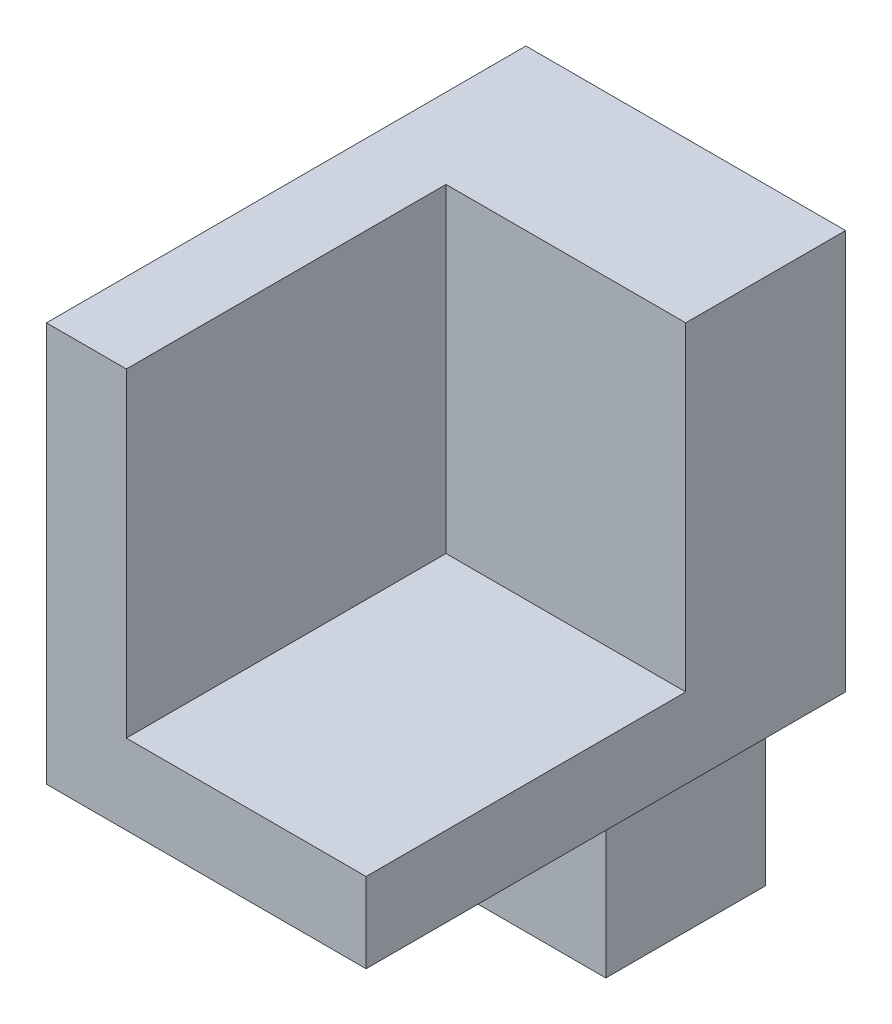
ISO-10303-21;
HEADER;
FILE_DESCRIPTION(('STEP AP214'),'2;1');
FILE_NAME('part.step','',(''),(''),'','','');
FILE_SCHEMA(('AUTOMOTIVE_DESIGN { 1 0 10303 214 1 1 1 1 }'));
ENDSEC;
DATA;
#1=APPLICATION_CONTEXT('core data for automotive mechanical design processes');
#2=APPLICATION_PROTOCOL_DEFINITION('international standard','automotive_design',2000,#1);
#3=PRODUCT_CONTEXT('',#1,'mechanical');
#4=PRODUCT('Part','Part','',(#3));
#5=PRODUCT_RELATED_PRODUCT_CATEGORY('part','',(#4));
#6=PRODUCT_DEFINITION_FORMATION('','',#4);
#7=PRODUCT_DEFINITION_CONTEXT('part definition',#1,'design');
#8=PRODUCT_DEFINITION('design','',#6,#7);
#9=PRODUCT_DEFINITION_SHAPE('','',#8);
#10=(LENGTH_UNIT() NAMED_UNIT(*) SI_UNIT(.MILLI.,.METRE.));
#11=(NAMED_UNIT(*) PLANE_ANGLE_UNIT() SI_UNIT($,.RADIAN.));
#12=(NAMED_UNIT(*) SI_UNIT($,.STERADIAN.) SOLID_ANGLE_UNIT());
#13=UNCERTAINTY_MEASURE_WITH_UNIT(LENGTH_MEASURE(1.E-05),#10,'distance_accuracy_value','');
#14=(GEOMETRIC_REPRESENTATION_CONTEXT(3) GLOBAL_UNCERTAINTY_ASSIGNED_CONTEXT((#13)) GLOBAL_UNIT_ASSIGNED_CONTEXT((#10,
#11,#12)) REPRESENTATION_CONTEXT('',''));
#15=CARTESIAN_POINT('',(0.,0.,0.));
#16=DIRECTION('',(0.,0.,1.));
#17=DIRECTION('',(1.,0.,0.));
#18=AXIS2_PLACEMENT_3D('',#15,#16,#17);
#19=CARTESIAN_POINT('',(0.,0.,0.));
#20=DIRECTION('',(1.,0.,0.));
#21=DIRECTION('',(0.,0.,-1.));
#22=AXIS2_PLACEMENT_3D('',#19,#20,#21);
#23=PLANE('',#22);
#24=DIRECTION('',(0.,0.,1.));
#25=VECTOR('',#24,1.);
#26=CARTESIAN_POINT('',(0.,-25.,0.));
#27=LINE('',#26,#25);
#28=CARTESIAN_POINT('',(0.,-25.,0.));
#29=VERTEX_POINT('',#28);
#30=CARTESIAN_POINT('',(0.,-25.,10.));
#31=VERTEX_POINT('',#30);
#32=EDGE_CURVE('E182',#29,#31,#27,.T.);
#33=ORIENTED_EDGE('',*,*,#32,.F.);
#34=DIRECTION('',(0.,1.,0.));
#35=VECTOR('',#34,1.);
#36=CARTESIAN_POINT('',(0.,-38.,0.));
#37=LINE('',#36,#35);
#38=CARTESIAN_POINT('',(0.,-38.,0.));
#39=VERTEX_POINT('',#38);
#40=EDGE_CURVE('E211',#39,#29,#37,.T.);
#41=ORIENTED_EDGE('',*,*,#40,.F.);
#42=DIRECTION('',(0.,0.,-1.));
#43=VECTOR('',#42,1.);
#44=CARTESIAN_POINT('',(0.,-38.,10.));
#45=LINE('',#44,#43);
#46=CARTESIAN_POINT('',(0.,-38.,10.));
#47=VERTEX_POINT('',#46);
#48=EDGE_CURVE('E84',#47,#39,#45,.T.);
#49=ORIENTED_EDGE('',*,*,#48,.F.);
#50=DIRECTION('',(0.,-1.,0.));
#51=VECTOR('',#50,1.);
#52=CARTESIAN_POINT('',(0.,-25.,10.));
#53=LINE('',#52,#51);
#54=EDGE_CURVE('E79',#31,#47,#53,.T.);
#55=ORIENTED_EDGE('',*,*,#54,.F.);
#56=EDGE_LOOP('',(#33,#41,#49,#55));
#57=FACE_BOUND('',#56,.T.);
#58=ADVANCED_FACE('F45',(#57),#23,.F.);
#59=CARTESIAN_POINT('',(10.,-38.,0.));
#60=DIRECTION('',(0.,0.,1.));
#61=DIRECTION('',(1.,0.,0.));
#62=AXIS2_PLACEMENT_3D('',#59,#60,#61);
#63=PLANE('',#62);
#64=ORIENTED_EDGE('',*,*,#40,.T.);
#65=DIRECTION('',(1.,0.,0.));
#66=VECTOR('',#65,1.);
#67=CARTESIAN_POINT('',(-5.,-25.,0.));
#68=LINE('',#67,#66);
#69=CARTESIAN_POINT('',(-5.,-25.,0.));
#70=VERTEX_POINT('',#69);
#71=EDGE_CURVE('E208',#70,#29,#68,.T.);
#72=ORIENTED_EDGE('',*,*,#71,.F.);
#73=DIRECTION('',(0.,-1.,0.));
#74=VECTOR('',#73,1.);
#75=CARTESIAN_POINT('',(-5.,0.,0.));
#76=LINE('',#75,#74);
#77=CARTESIAN_POINT('',(-5.,0.,0.));
#78=VERTEX_POINT('',#77);
#79=EDGE_CURVE('E183',#78,#70,#76,.T.);
#80=ORIENTED_EDGE('',*,*,#79,.F.);
#81=DIRECTION('',(-1.,0.,0.));
#82=VECTOR('',#81,1.);
#83=CARTESIAN_POINT('',(10.,0.,0.));
#84=LINE('',#83,#82);
#85=CARTESIAN_POINT('',(15.,0.,0.));
#86=VERTEX_POINT('',#85);
#87=EDGE_CURVE('E49',#86,#78,#84,.T.);
#88=ORIENTED_EDGE('',*,*,#87,.F.);
#89=DIRECTION('',(0.,1.,0.));
#90=VECTOR('',#89,1.);
#91=CARTESIAN_POINT('',(15.,-25.,0.));
#92=LINE('',#91,#90);
#93=CARTESIAN_POINT('',(15.,-25.,0.));
#94=VERTEX_POINT('',#93);
#95=EDGE_CURVE('E163',#94,#86,#92,.T.);
#96=ORIENTED_EDGE('',*,*,#95,.F.);
#97=DIRECTION('',(-1.,0.,0.));
#98=VECTOR('',#97,1.);
#99=CARTESIAN_POINT('',(15.,-25.,0.));
#100=LINE('',#99,#98);
#101=CARTESIAN_POINT('',(10.,-25.,0.));
#102=VERTEX_POINT('',#101);
#103=EDGE_CURVE('E177',#94,#102,#100,.T.);
#104=ORIENTED_EDGE('',*,*,#103,.T.);
#105=DIRECTION('',(0.,1.,0.));
#106=VECTOR('',#105,1.);
#107=CARTESIAN_POINT('',(10.,-38.,0.));
#108=LINE('',#107,#106);
#109=CARTESIAN_POINT('',(10.,-38.,0.));
#110=VERTEX_POINT('',#109);
#111=EDGE_CURVE('E212',#110,#102,#108,.T.);
#112=ORIENTED_EDGE('',*,*,#111,.F.);
#113=DIRECTION('',(-1.,0.,0.));
#114=VECTOR('',#113,1.);
#115=CARTESIAN_POINT('',(10.,-38.,0.));
#116=LINE('',#115,#114);
#117=EDGE_CURVE('E220',#110,#39,#116,.T.);
#118=ORIENTED_EDGE('',*,*,#117,.T.);
#119=EDGE_LOOP('',(#64,#72,#80,#88,#96,#104,#112,#118));
#120=FACE_BOUND('',#119,.T.);
#121=ADVANCED_FACE('F47',(#120),#63,.F.);
#122=CARTESIAN_POINT('',(10.,0.,0.));
#123=DIRECTION('',(0.,-1.,0.));
#124=DIRECTION('',(0.,0.,-1.));
#125=AXIS2_PLACEMENT_3D('',#122,#123,#124);
#126=PLANE('',#125);
#127=ORIENTED_EDGE('',*,*,#87,.T.);
#128=DIRECTION('',(0.,0.,-1.));
#129=VECTOR('',#128,1.);
#130=CARTESIAN_POINT('',(-5.,0.,0.));
#131=LINE('',#130,#129);
#132=CARTESIAN_POINT('',(-5.,0.,30.));
#133=VERTEX_POINT('',#132);
#134=EDGE_CURVE('E194',#133,#78,#131,.T.);
#135=ORIENTED_EDGE('',*,*,#134,.F.);
#136=DIRECTION('',(1.,0.,0.));
#137=VECTOR('',#136,1.);
#138=CARTESIAN_POINT('',(-5.,0.,30.));
#139=LINE('',#138,#137);
#140=CARTESIAN_POINT('',(0.,0.,30.));
#141=VERTEX_POINT('',#140);
#142=EDGE_CURVE('E198',#133,#141,#139,.T.);
#143=ORIENTED_EDGE('',*,*,#142,.T.);
#144=DIRECTION('',(0.,0.,-1.));
#145=VECTOR('',#144,1.);
#146=CARTESIAN_POINT('',(0.,0.,0.));
#147=LINE('',#146,#145);
#148=CARTESIAN_POINT('',(0.,0.,10.));
#149=VERTEX_POINT('',#148);
#150=EDGE_CURVE('E145',#141,#149,#147,.T.);
#151=ORIENTED_EDGE('',*,*,#150,.T.);
#152=DIRECTION('',(-1.,0.,0.));
#153=VECTOR('',#152,1.);
#154=CARTESIAN_POINT('',(10.,0.,10.));
#155=LINE('',#154,#153);
#156=CARTESIAN_POINT('',(15.,0.,10.));
#157=VERTEX_POINT('',#156);
#158=EDGE_CURVE('E138',#157,#149,#155,.T.);
#159=ORIENTED_EDGE('',*,*,#158,.F.);
#160=DIRECTION('',(0.,0.,1.));
#161=VECTOR('',#160,1.);
#162=CARTESIAN_POINT('',(15.,0.,0.));
#163=LINE('',#162,#161);
#164=EDGE_CURVE('E142',#86,#157,#163,.T.);
#165=ORIENTED_EDGE('',*,*,#164,.F.);
#166=EDGE_LOOP('',(#127,#135,#143,#151,#159,#165));
#167=FACE_BOUND('',#166,.T.);
#168=ADVANCED_FACE('F140',(#167),#126,.F.);
#169=CARTESIAN_POINT('',(10.,0.,10.));
#170=DIRECTION('',(0.,0.,-1.));
#171=DIRECTION('',(0.,1.,0.));
#172=AXIS2_PLACEMENT_3D('',#169,#170,#171);
#173=PLANE('',#172);
#174=DIRECTION('',(0.,-1.,0.));
#175=VECTOR('',#174,1.);
#176=CARTESIAN_POINT('',(0.,0.,10.));
#177=LINE('',#176,#175);
#178=CARTESIAN_POINT('',(0.,-20.,10.));
#179=VERTEX_POINT('',#178);
#180=EDGE_CURVE('E224',#149,#179,#177,.T.);
#181=ORIENTED_EDGE('',*,*,#180,.T.);
#182=DIRECTION('',(-1.,0.,0.));
#183=VECTOR('',#182,1.);
#184=CARTESIAN_POINT('',(10.,-20.,10.));
#185=LINE('',#184,#183);
#186=CARTESIAN_POINT('',(15.,-20.,10.));
#187=VERTEX_POINT('',#186);
#188=EDGE_CURVE('E149',#187,#179,#185,.T.);
#189=ORIENTED_EDGE('',*,*,#188,.F.);
#190=DIRECTION('',(0.,-1.,0.));
#191=VECTOR('',#190,1.);
#192=CARTESIAN_POINT('',(15.,0.,10.));
#193=LINE('',#192,#191);
#194=EDGE_CURVE('E151',#157,#187,#193,.T.);
#195=ORIENTED_EDGE('',*,*,#194,.F.);
#196=ORIENTED_EDGE('',*,*,#158,.T.);
#197=EDGE_LOOP('',(#181,#189,#195,#196));
#198=FACE_BOUND('',#197,.T.);
#199=ADVANCED_FACE('F152',(#198),#173,.F.);
#200=CARTESIAN_POINT('',(10.,-20.,10.));
#201=DIRECTION('',(0.,-1.,0.));
#202=DIRECTION('',(0.,0.,-1.));
#203=AXIS2_PLACEMENT_3D('',#200,#201,#202);
#204=PLANE('',#203);
#205=DIRECTION('',(0.,0.,1.));
#206=VECTOR('',#205,1.);
#207=CARTESIAN_POINT('',(0.,-20.,10.));
#208=LINE('',#207,#206);
#209=CARTESIAN_POINT('',(0.,-20.,30.));
#210=VERTEX_POINT('',#209);
#211=EDGE_CURVE('E227',#179,#210,#208,.T.);
#212=ORIENTED_EDGE('',*,*,#211,.T.);
#213=DIRECTION('',(-1.,0.,0.));
#214=VECTOR('',#213,1.);
#215=CARTESIAN_POINT('',(10.,-20.,30.));
#216=LINE('',#215,#214);
#217=CARTESIAN_POINT('',(15.,-20.,30.));
#218=VERTEX_POINT('',#217);
#219=EDGE_CURVE('E246',#218,#210,#216,.T.);
#220=ORIENTED_EDGE('',*,*,#219,.F.);
#221=DIRECTION('',(0.,0.,1.));
#222=VECTOR('',#221,1.);
#223=CARTESIAN_POINT('',(15.,-20.,10.));
#224=LINE('',#223,#222);
#225=EDGE_CURVE('E158',#187,#218,#224,.T.);
#226=ORIENTED_EDGE('',*,*,#225,.F.);
#227=ORIENTED_EDGE('',*,*,#188,.T.);
#228=EDGE_LOOP('',(#212,#220,#226,#227));
#229=FACE_BOUND('',#228,.T.);
#230=ADVANCED_FACE('F252',(#229),#204,.F.);
#231=CARTESIAN_POINT('',(10.,-20.,30.));
#232=DIRECTION('',(0.,0.,-1.));
#233=DIRECTION('',(0.,1.,0.));
#234=AXIS2_PLACEMENT_3D('',#231,#232,#233);
#235=PLANE('',#234);
#236=ORIENTED_EDGE('',*,*,#219,.T.);
#237=DIRECTION('',(0.,1.,0.));
#238=VECTOR('',#237,1.);
#239=CARTESIAN_POINT('',(0.,0.,30.));
#240=LINE('',#239,#238);
#241=EDGE_CURVE('E201',#210,#141,#240,.T.);
#242=ORIENTED_EDGE('',*,*,#241,.T.);
#243=ORIENTED_EDGE('',*,*,#142,.F.);
#244=DIRECTION('',(0.,1.,0.));
#245=VECTOR('',#244,1.);
#246=CARTESIAN_POINT('',(-5.,0.,30.));
#247=LINE('',#246,#245);
#248=CARTESIAN_POINT('',(-5.,-25.,30.));
#249=VERTEX_POINT('',#248);
#250=EDGE_CURVE('E191',#249,#133,#247,.T.);
#251=ORIENTED_EDGE('',*,*,#250,.F.);
#252=DIRECTION('',(-1.,0.,0.));
#253=VECTOR('',#252,1.);
#254=CARTESIAN_POINT('',(10.,-25.,30.));
#255=LINE('',#254,#253);
#256=CARTESIAN_POINT('',(15.,-25.,30.));
#257=VERTEX_POINT('',#256);
#258=EDGE_CURVE('E243',#257,#249,#255,.T.);
#259=ORIENTED_EDGE('',*,*,#258,.F.);
#260=DIRECTION('',(0.,-1.,0.));
#261=VECTOR('',#260,1.);
#262=CARTESIAN_POINT('',(15.,-20.,30.));
#263=LINE('',#262,#261);
#264=EDGE_CURVE('E169',#218,#257,#263,.T.);
#265=ORIENTED_EDGE('',*,*,#264,.F.);
#266=EDGE_LOOP('',(#236,#242,#243,#251,#259,#265));
#267=FACE_BOUND('',#266,.T.);
#268=ADVANCED_FACE('F256',(#267),#235,.F.);
#269=CARTESIAN_POINT('',(10.,-25.,30.));
#270=DIRECTION('',(0.,1.,0.));
#271=DIRECTION('',(0.,0.,1.));
#272=AXIS2_PLACEMENT_3D('',#269,#270,#271);
#273=PLANE('',#272);
#274=ORIENTED_EDGE('',*,*,#258,.T.);
#275=DIRECTION('',(0.,0.,1.));
#276=VECTOR('',#275,1.);
#277=CARTESIAN_POINT('',(-5.,-25.,0.));
#278=LINE('',#277,#276);
#279=EDGE_CURVE('E187',#70,#249,#278,.T.);
#280=ORIENTED_EDGE('',*,*,#279,.F.);
#281=ORIENTED_EDGE('',*,*,#71,.T.);
#282=ORIENTED_EDGE('',*,*,#32,.T.);
#283=DIRECTION('',(-1.,0.,0.));
#284=VECTOR('',#283,1.);
#285=CARTESIAN_POINT('',(10.,-25.,10.));
#286=LINE('',#285,#284);
#287=CARTESIAN_POINT('',(10.,-25.,10.));
#288=VERTEX_POINT('',#287);
#289=EDGE_CURVE('E240',#288,#31,#286,.T.);
#290=ORIENTED_EDGE('',*,*,#289,.F.);
#291=DIRECTION('',(0.,0.,-1.));
#292=VECTOR('',#291,1.);
#293=CARTESIAN_POINT('',(10.,-25.,10.));
#294=LINE('',#293,#292);
#295=EDGE_CURVE('E11',#288,#102,#294,.T.);
#296=ORIENTED_EDGE('',*,*,#295,.T.);
#297=ORIENTED_EDGE('',*,*,#103,.F.);
#298=DIRECTION('',(0.,0.,-1.));
#299=VECTOR('',#298,1.);
#300=CARTESIAN_POINT('',(15.,-25.,30.));
#301=LINE('',#300,#299);
#302=EDGE_CURVE('E173',#257,#94,#301,.T.);
#303=ORIENTED_EDGE('',*,*,#302,.F.);
#304=EDGE_LOOP('',(#274,#280,#281,#282,#290,#296,#297,#303));
#305=FACE_BOUND('',#304,.T.);
#306=ADVANCED_FACE('F260',(#305),#273,.F.);
#307=CARTESIAN_POINT('',(10.,-25.,10.));
#308=DIRECTION('',(0.,0.,-1.));
#309=DIRECTION('',(0.,1.,0.));
#310=AXIS2_PLACEMENT_3D('',#307,#308,#309);
#311=PLANE('',#310);
#312=ORIENTED_EDGE('',*,*,#54,.T.);
#313=DIRECTION('',(-1.,0.,0.));
#314=VECTOR('',#313,1.);
#315=CARTESIAN_POINT('',(10.,-38.,10.));
#316=LINE('',#315,#314);
#317=CARTESIAN_POINT('',(10.,-38.,10.));
#318=VERTEX_POINT('',#317);
#319=EDGE_CURVE('E237',#318,#47,#316,.T.);
#320=ORIENTED_EDGE('',*,*,#319,.F.);
#321=DIRECTION('',(0.,-1.,0.));
#322=VECTOR('',#321,1.);
#323=CARTESIAN_POINT('',(10.,-25.,10.));
#324=LINE('',#323,#322);
#325=EDGE_CURVE('E215',#288,#318,#324,.T.);
#326=ORIENTED_EDGE('',*,*,#325,.F.);
#327=ORIENTED_EDGE('',*,*,#289,.T.);
#328=EDGE_LOOP('',(#312,#320,#326,#327));
#329=FACE_BOUND('',#328,.T.);
#330=ADVANCED_FACE('F284',(#329),#311,.F.);
#331=CARTESIAN_POINT('',(10.,-38.,10.));
#332=DIRECTION('',(0.,1.,0.));
#333=DIRECTION('',(0.,0.,1.));
#334=AXIS2_PLACEMENT_3D('',#331,#332,#333);
#335=PLANE('',#334);
#336=ORIENTED_EDGE('',*,*,#48,.T.);
#337=ORIENTED_EDGE('',*,*,#117,.F.);
#338=DIRECTION('',(0.,0.,-1.));
#339=VECTOR('',#338,1.);
#340=CARTESIAN_POINT('',(10.,-38.,10.));
#341=LINE('',#340,#339);
#342=EDGE_CURVE('E64',#318,#110,#341,.T.);
#343=ORIENTED_EDGE('',*,*,#342,.F.);
#344=ORIENTED_EDGE('',*,*,#319,.T.);
#345=EDGE_LOOP('',(#336,#337,#343,#344));
#346=FACE_BOUND('',#345,.T.);
#347=ADVANCED_FACE('F282',(#346),#335,.F.);
#348=CARTESIAN_POINT('',(10.,0.,0.));
#349=DIRECTION('',(1.,0.,0.));
#350=DIRECTION('',(0.,0.,-1.));
#351=AXIS2_PLACEMENT_3D('',#348,#349,#350);
#352=PLANE('',#351);
#353=ORIENTED_EDGE('',*,*,#295,.F.);
#354=ORIENTED_EDGE('',*,*,#325,.T.);
#355=ORIENTED_EDGE('',*,*,#342,.T.);
#356=ORIENTED_EDGE('',*,*,#111,.T.);
#357=EDGE_LOOP('',(#353,#354,#355,#356));
#358=FACE_BOUND('',#357,.T.);
#359=ADVANCED_FACE('F280',(#358),#352,.T.);
#360=CARTESIAN_POINT('',(-5.,0.,0.));
#361=DIRECTION('',(-1.,0.,0.));
#362=DIRECTION('',(0.,0.,1.));
#363=AXIS2_PLACEMENT_3D('',#360,#361,#362);
#364=PLANE('',#363);
#365=ORIENTED_EDGE('',*,*,#79,.T.);
#366=ORIENTED_EDGE('',*,*,#279,.T.);
#367=ORIENTED_EDGE('',*,*,#250,.T.);
#368=ORIENTED_EDGE('',*,*,#134,.T.);
#369=EDGE_LOOP('',(#365,#366,#367,#368));
#370=FACE_BOUND('',#369,.T.);
#371=ADVANCED_FACE('F263',(#370),#364,.T.);
#372=CARTESIAN_POINT('',(0.,0.,0.));
#373=DIRECTION('',(-1.,0.,0.));
#374=DIRECTION('',(0.,0.,1.));
#375=AXIS2_PLACEMENT_3D('',#372,#373,#374);
#376=PLANE('',#375);
#377=ORIENTED_EDGE('',*,*,#211,.F.);
#378=ORIENTED_EDGE('',*,*,#180,.F.);
#379=ORIENTED_EDGE('',*,*,#150,.F.);
#380=ORIENTED_EDGE('',*,*,#241,.F.);
#381=EDGE_LOOP('',(#377,#378,#379,#380));
#382=FACE_BOUND('',#381,.T.);
#383=ADVANCED_FACE('F340',(#382),#376,.F.);
#384=CARTESIAN_POINT('',(15.,0.,0.));
#385=DIRECTION('',(1.,0.,0.));
#386=DIRECTION('',(0.,0.,-1.));
#387=AXIS2_PLACEMENT_3D('',#384,#385,#386);
#388=PLANE('',#387);
#389=ORIENTED_EDGE('',*,*,#164,.T.);
#390=ORIENTED_EDGE('',*,*,#194,.T.);
#391=ORIENTED_EDGE('',*,*,#225,.T.);
#392=ORIENTED_EDGE('',*,*,#264,.T.);
#393=ORIENTED_EDGE('',*,*,#302,.T.);
#394=ORIENTED_EDGE('',*,*,#95,.T.);
#395=EDGE_LOOP('',(#389,#390,#391,#392,#393,#394));
#396=FACE_BOUND('',#395,.T.);
#397=ADVANCED_FACE('F161',(#396),#388,.T.);
#398=CLOSED_SHELL('',(#58,#121,#168,#199,#230,#268,#306,#330,#347,#359,#371,#383,#397));
#399=MANIFOLD_SOLID_BREP('B2',#398);
#400=ADVANCED_BREP_SHAPE_REPRESENTATION('',(#18,#399),#14);
#401=SHAPE_DEFINITION_REPRESENTATION(#9,#400);
ENDSEC;
END-ISO-10303-21;
